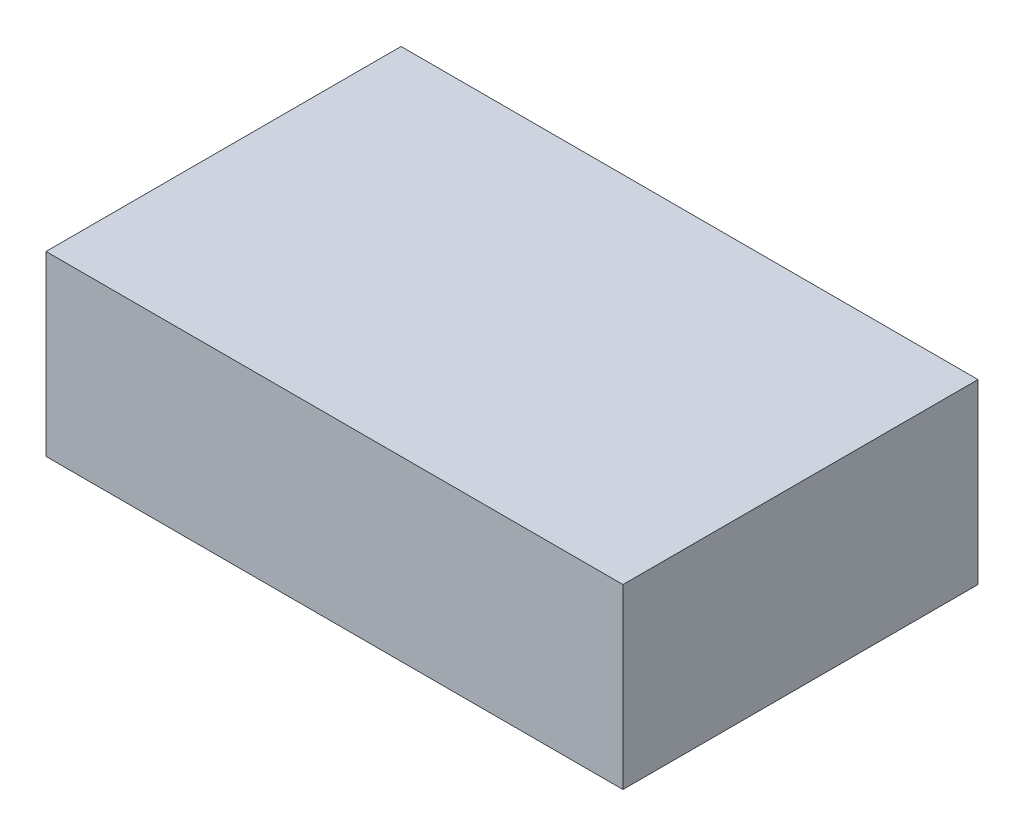
ISO-10303-21;
HEADER;
FILE_DESCRIPTION(('STEP AP214'),'2;1');
FILE_NAME('part.step','',(''),(''),'','','');
FILE_SCHEMA(('AUTOMOTIVE_DESIGN { 1 0 10303 214 1 1 1 1 }'));
ENDSEC;
DATA;
#1=APPLICATION_CONTEXT('core data for automotive mechanical design processes');
#2=APPLICATION_PROTOCOL_DEFINITION('international standard','automotive_design',2000,#1);
#3=PRODUCT_CONTEXT('',#1,'mechanical');
#4=PRODUCT('Part','Part','',(#3));
#5=PRODUCT_RELATED_PRODUCT_CATEGORY('part','',(#4));
#6=PRODUCT_DEFINITION_FORMATION('','',#4);
#7=PRODUCT_DEFINITION_CONTEXT('part definition',#1,'design');
#8=PRODUCT_DEFINITION('design','',#6,#7);
#9=PRODUCT_DEFINITION_SHAPE('','',#8);
#10=(LENGTH_UNIT() NAMED_UNIT(*) SI_UNIT(.MILLI.,.METRE.));
#11=(NAMED_UNIT(*) PLANE_ANGLE_UNIT() SI_UNIT($,.RADIAN.));
#12=(NAMED_UNIT(*) SI_UNIT($,.STERADIAN.) SOLID_ANGLE_UNIT());
#13=UNCERTAINTY_MEASURE_WITH_UNIT(LENGTH_MEASURE(1.E-05),#10,'distance_accuracy_value','');
#14=(GEOMETRIC_REPRESENTATION_CONTEXT(3) GLOBAL_UNCERTAINTY_ASSIGNED_CONTEXT((#13)) GLOBAL_UNIT_ASSIGNED_CONTEXT((#10,
#11,#12)) REPRESENTATION_CONTEXT('',''));
#15=CARTESIAN_POINT('',(0.,0.,0.));
#16=DIRECTION('',(0.,0.,1.));
#17=DIRECTION('',(1.,0.,0.));
#18=AXIS2_PLACEMENT_3D('',#15,#16,#17);
#19=CARTESIAN_POINT('',(0.,0.8,0.));
#20=DIRECTION('',(-1.,0.,0.));
#21=DIRECTION('',(0.,0.,1.));
#22=AXIS2_PLACEMENT_3D('',#19,#20,#21);
#23=PLANE('',#22);
#24=DIRECTION('',(0.,0.,-1.));
#25=VECTOR('',#24,1.);
#26=CARTESIAN_POINT('',(0.,0.,0.));
#27=LINE('',#26,#25);
#28=CARTESIAN_POINT('',(0.,0.,0.));
#29=VERTEX_POINT('',#28);
#30=CARTESIAN_POINT('',(0.,0.,-1.6));
#31=VERTEX_POINT('',#30);
#32=EDGE_CURVE('E110',#29,#31,#27,.T.);
#33=ORIENTED_EDGE('',*,*,#32,.F.);
#34=DIRECTION('',(0.,-1.,0.));
#35=VECTOR('',#34,1.);
#36=CARTESIAN_POINT('',(0.,0.8,0.));
#37=LINE('',#36,#35);
#38=CARTESIAN_POINT('',(0.,0.8,0.));
#39=VERTEX_POINT('',#38);
#40=EDGE_CURVE('E11',#39,#29,#37,.T.);
#41=ORIENTED_EDGE('',*,*,#40,.F.);
#42=DIRECTION('',(0.,0.,-1.));
#43=VECTOR('',#42,1.);
#44=CARTESIAN_POINT('',(0.,0.8,0.));
#45=LINE('',#44,#43);
#46=CARTESIAN_POINT('',(0.,0.8,-1.6));
#47=VERTEX_POINT('',#46);
#48=EDGE_CURVE('E103',#39,#47,#45,.T.);
#49=ORIENTED_EDGE('',*,*,#48,.T.);
#50=DIRECTION('',(0.,-1.,0.));
#51=VECTOR('',#50,1.);
#52=CARTESIAN_POINT('',(0.,0.8,-1.6));
#53=LINE('',#52,#51);
#54=EDGE_CURVE('E42',#47,#31,#53,.T.);
#55=ORIENTED_EDGE('',*,*,#54,.T.);
#56=EDGE_LOOP('',(#33,#41,#49,#55));
#57=FACE_BOUND('',#56,.T.);
#58=ADVANCED_FACE('F39',(#57),#23,.T.);
#59=CARTESIAN_POINT('',(0.,0.8,0.));
#60=DIRECTION('',(0.,0.,-1.));
#61=DIRECTION('',(-1.,0.,0.));
#62=AXIS2_PLACEMENT_3D('',#59,#60,#61);
#63=PLANE('',#62);
#64=DIRECTION('',(1.,0.,0.));
#65=VECTOR('',#64,1.);
#66=CARTESIAN_POINT('',(0.,0.,0.));
#67=LINE('',#66,#65);
#68=CARTESIAN_POINT('',(2.6,0.,0.));
#69=VERTEX_POINT('',#68);
#70=EDGE_CURVE('E73',#29,#69,#67,.T.);
#71=ORIENTED_EDGE('',*,*,#70,.T.);
#72=DIRECTION('',(0.,-1.,0.));
#73=VECTOR('',#72,1.);
#74=CARTESIAN_POINT('',(2.6,0.8,0.));
#75=LINE('',#74,#73);
#76=CARTESIAN_POINT('',(2.6,0.8,0.));
#77=VERTEX_POINT('',#76);
#78=EDGE_CURVE('E49',#77,#69,#75,.T.);
#79=ORIENTED_EDGE('',*,*,#78,.F.);
#80=DIRECTION('',(1.,0.,0.));
#81=VECTOR('',#80,1.);
#82=CARTESIAN_POINT('',(0.,0.8,0.));
#83=LINE('',#82,#81);
#84=EDGE_CURVE('E90',#39,#77,#83,.T.);
#85=ORIENTED_EDGE('',*,*,#84,.F.);
#86=ORIENTED_EDGE('',*,*,#40,.T.);
#87=EDGE_LOOP('',(#71,#79,#85,#86));
#88=FACE_BOUND('',#87,.T.);
#89=ADVANCED_FACE('F126',(#88),#63,.F.);
#90=CARTESIAN_POINT('',(2.6,0.8,0.));
#91=DIRECTION('',(-1.,0.,0.));
#92=DIRECTION('',(0.,0.,1.));
#93=AXIS2_PLACEMENT_3D('',#90,#91,#92);
#94=PLANE('',#93);
#95=DIRECTION('',(0.,0.,-1.));
#96=VECTOR('',#95,1.);
#97=CARTESIAN_POINT('',(2.6,0.,0.));
#98=LINE('',#97,#96);
#99=CARTESIAN_POINT('',(2.6,0.,-1.6));
#100=VERTEX_POINT('',#99);
#101=EDGE_CURVE('E98',#69,#100,#98,.T.);
#102=ORIENTED_EDGE('',*,*,#101,.T.);
#103=DIRECTION('',(0.,-1.,0.));
#104=VECTOR('',#103,1.);
#105=CARTESIAN_POINT('',(2.6,0.8,-1.6));
#106=LINE('',#105,#104);
#107=CARTESIAN_POINT('',(2.6,0.8,-1.6));
#108=VERTEX_POINT('',#107);
#109=EDGE_CURVE('E95',#108,#100,#106,.T.);
#110=ORIENTED_EDGE('',*,*,#109,.F.);
#111=DIRECTION('',(0.,0.,-1.));
#112=VECTOR('',#111,1.);
#113=CARTESIAN_POINT('',(2.6,0.8,0.));
#114=LINE('',#113,#112);
#115=EDGE_CURVE('E85',#77,#108,#114,.T.);
#116=ORIENTED_EDGE('',*,*,#115,.F.);
#117=ORIENTED_EDGE('',*,*,#78,.T.);
#118=EDGE_LOOP('',(#102,#110,#116,#117));
#119=FACE_BOUND('',#118,.T.);
#120=ADVANCED_FACE('F96',(#119),#94,.F.);
#121=CARTESIAN_POINT('',(0.,0.8,-1.6));
#122=DIRECTION('',(0.,0.,-1.));
#123=DIRECTION('',(-1.,0.,0.));
#124=AXIS2_PLACEMENT_3D('',#121,#122,#123);
#125=PLANE('',#124);
#126=DIRECTION('',(1.,0.,0.));
#127=VECTOR('',#126,1.);
#128=CARTESIAN_POINT('',(0.,0.,-1.6));
#129=LINE('',#128,#127);
#130=EDGE_CURVE('E114',#31,#100,#129,.T.);
#131=ORIENTED_EDGE('',*,*,#130,.F.);
#132=ORIENTED_EDGE('',*,*,#54,.F.);
#133=DIRECTION('',(1.,0.,0.));
#134=VECTOR('',#133,1.);
#135=CARTESIAN_POINT('',(0.,0.8,-1.6));
#136=LINE('',#135,#134);
#137=EDGE_CURVE('E89',#47,#108,#136,.T.);
#138=ORIENTED_EDGE('',*,*,#137,.T.);
#139=ORIENTED_EDGE('',*,*,#109,.T.);
#140=EDGE_LOOP('',(#131,#132,#138,#139));
#141=FACE_BOUND('',#140,.T.);
#142=ADVANCED_FACE('F101',(#141),#125,.T.);
#143=CARTESIAN_POINT('',(0.,0.8,0.));
#144=DIRECTION('',(0.,-1.,0.));
#145=DIRECTION('',(0.,0.,-1.));
#146=AXIS2_PLACEMENT_3D('',#143,#144,#145);
#147=PLANE('',#146);
#148=ORIENTED_EDGE('',*,*,#48,.F.);
#149=ORIENTED_EDGE('',*,*,#84,.T.);
#150=ORIENTED_EDGE('',*,*,#115,.T.);
#151=ORIENTED_EDGE('',*,*,#137,.F.);
#152=EDGE_LOOP('',(#148,#149,#150,#151));
#153=FACE_BOUND('',#152,.T.);
#154=ADVANCED_FACE('F88',(#153),#147,.F.);
#155=CARTESIAN_POINT('',(0.,0.,0.));
#156=DIRECTION('',(0.,-1.,0.));
#157=DIRECTION('',(0.,0.,-1.));
#158=AXIS2_PLACEMENT_3D('',#155,#156,#157);
#159=PLANE('',#158);
#160=ORIENTED_EDGE('',*,*,#32,.T.);
#161=ORIENTED_EDGE('',*,*,#130,.T.);
#162=ORIENTED_EDGE('',*,*,#101,.F.);
#163=ORIENTED_EDGE('',*,*,#70,.F.);
#164=EDGE_LOOP('',(#160,#161,#162,#163));
#165=FACE_BOUND('',#164,.T.);
#166=ADVANCED_FACE('F123',(#165),#159,.T.);
#167=CLOSED_SHELL('',(#58,#89,#120,#142,#154,#166));
#168=MANIFOLD_SOLID_BREP('B2',#167);
#169=ADVANCED_BREP_SHAPE_REPRESENTATION('',(#18,#168),#14);
#170=SHAPE_DEFINITION_REPRESENTATION(#9,#169);
ENDSEC;
END-ISO-10303-21;
